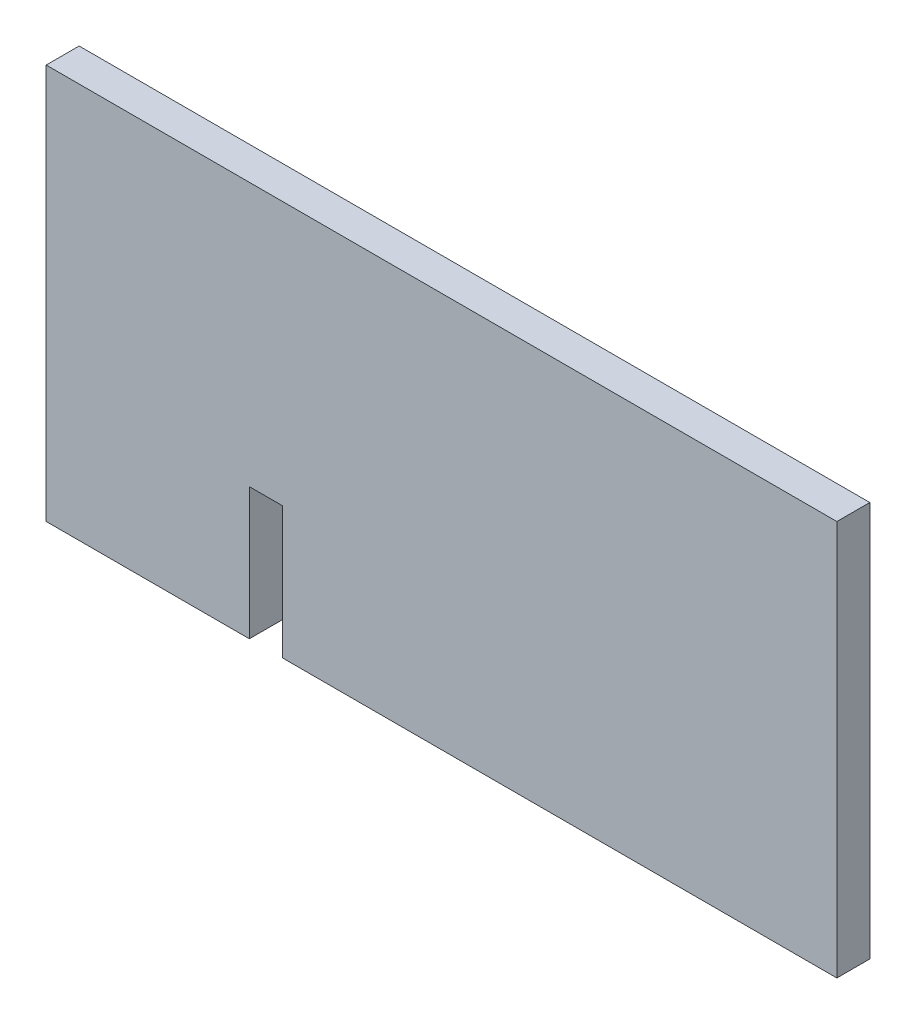
ISO-10303-21;
HEADER;
FILE_DESCRIPTION(('STEP AP214'),'2;1');
FILE_NAME('part.step','',(''),(''),'','','');
FILE_SCHEMA(('AUTOMOTIVE_DESIGN { 1 0 10303 214 1 1 1 1 }'));
ENDSEC;
DATA;
#1=APPLICATION_CONTEXT('core data for automotive mechanical design processes');
#2=APPLICATION_PROTOCOL_DEFINITION('international standard','automotive_design',2000,#1);
#3=PRODUCT_CONTEXT('',#1,'mechanical');
#4=PRODUCT('Part','Part','',(#3));
#5=PRODUCT_RELATED_PRODUCT_CATEGORY('part','',(#4));
#6=PRODUCT_DEFINITION_FORMATION('','',#4);
#7=PRODUCT_DEFINITION_CONTEXT('part definition',#1,'design');
#8=PRODUCT_DEFINITION('design','',#6,#7);
#9=PRODUCT_DEFINITION_SHAPE('','',#8);
#10=(LENGTH_UNIT() NAMED_UNIT(*) SI_UNIT(.MILLI.,.METRE.));
#11=(NAMED_UNIT(*) PLANE_ANGLE_UNIT() SI_UNIT($,.RADIAN.));
#12=(NAMED_UNIT(*) SI_UNIT($,.STERADIAN.) SOLID_ANGLE_UNIT());
#13=UNCERTAINTY_MEASURE_WITH_UNIT(LENGTH_MEASURE(1.E-05),#10,'distance_accuracy_value','');
#14=(GEOMETRIC_REPRESENTATION_CONTEXT(3) GLOBAL_UNCERTAINTY_ASSIGNED_CONTEXT((#13)) GLOBAL_UNIT_ASSIGNED_CONTEXT((#10,
#11,#12)) REPRESENTATION_CONTEXT('',''));
#15=CARTESIAN_POINT('',(0.,0.,0.));
#16=DIRECTION('',(0.,0.,1.));
#17=DIRECTION('',(1.,0.,0.));
#18=AXIS2_PLACEMENT_3D('',#15,#16,#17);
#19=CARTESIAN_POINT('',(-555.522580204597,0.,38.1));
#20=DIRECTION('',(0.,-1.,0.));
#21=DIRECTION('',(0.,0.,-1.));
#22=AXIS2_PLACEMENT_3D('',#19,#20,#21);
#23=PLANE('',#22);
#24=DIRECTION('',(0.,0.,-1.));
#25=VECTOR('',#24,1.);
#26=CARTESIAN_POINT('',(-679.45,0.,19.05));
#27=LINE('',#26,#25);
#28=CARTESIAN_POINT('',(-679.45,0.,38.1));
#29=VERTEX_POINT('',#28);
#30=CARTESIAN_POINT('',(-679.45,0.,0.));
#31=VERTEX_POINT('',#30);
#32=EDGE_CURVE('E203',#29,#31,#27,.T.);
#33=ORIENTED_EDGE('',*,*,#32,.F.);
#34=DIRECTION('',(-1.,0.,0.));
#35=VECTOR('',#34,1.);
#36=CARTESIAN_POINT('',(-555.522580204597,0.,38.1));
#37=LINE('',#36,#35);
#38=CARTESIAN_POINT('',(-914.4,0.,38.1));
#39=VERTEX_POINT('',#38);
#40=EDGE_CURVE('E50',#29,#39,#37,.T.);
#41=ORIENTED_EDGE('',*,*,#40,.T.);
#42=DIRECTION('',(0.,0.,-1.));
#43=VECTOR('',#42,1.);
#44=CARTESIAN_POINT('',(-914.4,0.,38.1));
#45=LINE('',#44,#43);
#46=CARTESIAN_POINT('',(-914.4,0.,0.));
#47=VERTEX_POINT('',#46);
#48=EDGE_CURVE('E156',#39,#47,#45,.T.);
#49=ORIENTED_EDGE('',*,*,#48,.T.);
#50=DIRECTION('',(-1.,0.,0.));
#51=VECTOR('',#50,1.);
#52=CARTESIAN_POINT('',(-555.522580204597,0.,0.));
#53=LINE('',#52,#51);
#54=EDGE_CURVE('E77',#31,#47,#53,.T.);
#55=ORIENTED_EDGE('',*,*,#54,.F.);
#56=EDGE_LOOP('',(#33,#41,#49,#55));
#57=FACE_BOUND('',#56,.T.);
#58=ADVANCED_FACE('F16',(#57),#23,.T.);
#59=CARTESIAN_POINT('',(-457.2,228.6,38.1));
#60=DIRECTION('',(0.,0.,1.));
#61=DIRECTION('',(1.,0.,0.));
#62=AXIS2_PLACEMENT_3D('',#59,#60,#61);
#63=PLANE('',#62);
#64=DIRECTION('',(-1.,0.,0.));
#65=VECTOR('',#64,1.);
#66=CARTESIAN_POINT('',(-555.522580204597,152.4,38.1));
#67=LINE('',#66,#65);
#68=CARTESIAN_POINT('',(-641.35,152.4,38.1));
#69=VERTEX_POINT('',#68);
#70=CARTESIAN_POINT('',(-679.45,152.4,38.1));
#71=VERTEX_POINT('',#70);
#72=EDGE_CURVE('E119',#69,#71,#67,.T.);
#73=ORIENTED_EDGE('',*,*,#72,.F.);
#74=DIRECTION('',(0.,-1.,0.));
#75=VECTOR('',#74,1.);
#76=CARTESIAN_POINT('',(-641.35,152.4,38.1));
#77=LINE('',#76,#75);
#78=CARTESIAN_POINT('',(-641.35,0.,38.1));
#79=VERTEX_POINT('',#78);
#80=EDGE_CURVE('E213',#69,#79,#77,.T.);
#81=ORIENTED_EDGE('',*,*,#80,.T.);
#82=CARTESIAN_POINT('',(0.,0.,38.1));
#83=VERTEX_POINT('',#82);
#84=EDGE_CURVE('E144',#83,#79,#37,.T.);
#85=ORIENTED_EDGE('',*,*,#84,.F.);
#86=DIRECTION('',(0.,1.,0.));
#87=VECTOR('',#86,1.);
#88=CARTESIAN_POINT('',(0.,228.6,38.1));
#89=LINE('',#88,#87);
#90=CARTESIAN_POINT('',(0.,457.2,38.1));
#91=VERTEX_POINT('',#90);
#92=EDGE_CURVE('E147',#83,#91,#89,.T.);
#93=ORIENTED_EDGE('',*,*,#92,.T.);
#94=DIRECTION('',(-1.,0.,0.));
#95=VECTOR('',#94,1.);
#96=CARTESIAN_POINT('',(-555.522580204597,457.2,38.1));
#97=LINE('',#96,#95);
#98=CARTESIAN_POINT('',(-914.4,457.2,38.1));
#99=VERTEX_POINT('',#98);
#100=EDGE_CURVE('E150',#91,#99,#97,.T.);
#101=ORIENTED_EDGE('',*,*,#100,.T.);
#102=DIRECTION('',(0.,1.,0.));
#103=VECTOR('',#102,1.);
#104=CARTESIAN_POINT('',(-914.4,228.6,38.1));
#105=LINE('',#104,#103);
#106=EDGE_CURVE('E153',#39,#99,#105,.T.);
#107=ORIENTED_EDGE('',*,*,#106,.F.);
#108=ORIENTED_EDGE('',*,*,#40,.F.);
#109=DIRECTION('',(0.,-1.,0.));
#110=VECTOR('',#109,1.);
#111=CARTESIAN_POINT('',(-679.45,152.4,38.1));
#112=LINE('',#111,#110);
#113=EDGE_CURVE('E114',#71,#29,#112,.T.);
#114=ORIENTED_EDGE('',*,*,#113,.F.);
#115=EDGE_LOOP('',(#73,#81,#85,#93,#101,#107,#108,#114));
#116=FACE_BOUND('',#115,.T.);
#117=ADVANCED_FACE('F131',(#116),#63,.T.);
#118=DIRECTION('',(0.,0.,1.));
#119=VECTOR('',#118,1.);
#120=CARTESIAN_POINT('',(-641.35,0.,19.05));
#121=LINE('',#120,#119);
#122=CARTESIAN_POINT('',(-641.35,0.,0.));
#123=VERTEX_POINT('',#122);
#124=EDGE_CURVE('E129',#123,#79,#121,.T.);
#125=ORIENTED_EDGE('',*,*,#124,.F.);
#126=CARTESIAN_POINT('',(0.,0.,0.));
#127=VERTEX_POINT('',#126);
#128=EDGE_CURVE('E138',#127,#123,#53,.T.);
#129=ORIENTED_EDGE('',*,*,#128,.F.);
#130=DIRECTION('',(0.,0.,-1.));
#131=VECTOR('',#130,1.);
#132=CARTESIAN_POINT('',(0.,0.,38.1));
#133=LINE('',#132,#131);
#134=EDGE_CURVE('E11',#83,#127,#133,.T.);
#135=ORIENTED_EDGE('',*,*,#134,.F.);
#136=ORIENTED_EDGE('',*,*,#84,.T.);
#137=EDGE_LOOP('',(#125,#129,#135,#136));
#138=FACE_BOUND('',#137,.T.);
#139=ADVANCED_FACE('F18',(#138),#23,.T.);
#140=CARTESIAN_POINT('',(0.,228.6,38.1));
#141=DIRECTION('',(-1.,0.,0.));
#142=DIRECTION('',(0.,0.,1.));
#143=AXIS2_PLACEMENT_3D('',#140,#141,#142);
#144=PLANE('',#143);
#145=DIRECTION('',(0.,1.,0.));
#146=VECTOR('',#145,1.);
#147=CARTESIAN_POINT('',(0.,228.6,0.));
#148=LINE('',#147,#146);
#149=CARTESIAN_POINT('',(0.,457.2,0.));
#150=VERTEX_POINT('',#149);
#151=EDGE_CURVE('E160',#127,#150,#148,.T.);
#152=ORIENTED_EDGE('',*,*,#151,.T.);
#153=DIRECTION('',(0.,0.,-1.));
#154=VECTOR('',#153,1.);
#155=CARTESIAN_POINT('',(0.,457.2,38.1));
#156=LINE('',#155,#154);
#157=EDGE_CURVE('E25',#91,#150,#156,.T.);
#158=ORIENTED_EDGE('',*,*,#157,.F.);
#159=ORIENTED_EDGE('',*,*,#92,.F.);
#160=ORIENTED_EDGE('',*,*,#134,.T.);
#161=EDGE_LOOP('',(#152,#158,#159,#160));
#162=FACE_BOUND('',#161,.T.);
#163=ADVANCED_FACE('F190',(#162),#144,.F.);
#164=CARTESIAN_POINT('',(-555.522580204597,457.2,38.1));
#165=DIRECTION('',(0.,-1.,0.));
#166=DIRECTION('',(0.,0.,-1.));
#167=AXIS2_PLACEMENT_3D('',#164,#165,#166);
#168=PLANE('',#167);
#169=DIRECTION('',(-1.,0.,0.));
#170=VECTOR('',#169,1.);
#171=CARTESIAN_POINT('',(-555.522580204597,457.2,0.));
#172=LINE('',#171,#170);
#173=CARTESIAN_POINT('',(-914.4,457.2,0.));
#174=VERTEX_POINT('',#173);
#175=EDGE_CURVE('E163',#150,#174,#172,.T.);
#176=ORIENTED_EDGE('',*,*,#175,.T.);
#177=DIRECTION('',(0.,0.,-1.));
#178=VECTOR('',#177,1.);
#179=CARTESIAN_POINT('',(-914.4,457.2,38.1));
#180=LINE('',#179,#178);
#181=EDGE_CURVE('E172',#99,#174,#180,.T.);
#182=ORIENTED_EDGE('',*,*,#181,.F.);
#183=ORIENTED_EDGE('',*,*,#100,.F.);
#184=ORIENTED_EDGE('',*,*,#157,.T.);
#185=EDGE_LOOP('',(#176,#182,#183,#184));
#186=FACE_BOUND('',#185,.T.);
#187=ADVANCED_FACE('F181',(#186),#168,.F.);
#188=CARTESIAN_POINT('',(-914.4,228.6,38.1));
#189=DIRECTION('',(-1.,0.,0.));
#190=DIRECTION('',(0.,-1.,0.));
#191=AXIS2_PLACEMENT_3D('',#188,#189,#190);
#192=PLANE('',#191);
#193=DIRECTION('',(0.,1.,0.));
#194=VECTOR('',#193,1.);
#195=CARTESIAN_POINT('',(-914.4,228.6,0.));
#196=LINE('',#195,#194);
#197=EDGE_CURVE('E167',#47,#174,#196,.T.);
#198=ORIENTED_EDGE('',*,*,#197,.F.);
#199=ORIENTED_EDGE('',*,*,#48,.F.);
#200=ORIENTED_EDGE('',*,*,#106,.T.);
#201=ORIENTED_EDGE('',*,*,#181,.T.);
#202=EDGE_LOOP('',(#198,#199,#200,#201));
#203=FACE_BOUND('',#202,.T.);
#204=ADVANCED_FACE('F188',(#203),#192,.T.);
#205=CARTESIAN_POINT('',(-457.2,228.6,0.));
#206=DIRECTION('',(0.,0.,1.));
#207=DIRECTION('',(1.,0.,0.));
#208=AXIS2_PLACEMENT_3D('',#205,#206,#207);
#209=PLANE('',#208);
#210=DIRECTION('',(-1.,0.,0.));
#211=VECTOR('',#210,1.);
#212=CARTESIAN_POINT('',(-555.522580204597,152.4,0.));
#213=LINE('',#212,#211);
#214=CARTESIAN_POINT('',(-641.35,152.4,0.));
#215=VERTEX_POINT('',#214);
#216=CARTESIAN_POINT('',(-679.45,152.4,0.));
#217=VERTEX_POINT('',#216);
#218=EDGE_CURVE('E118',#215,#217,#213,.T.);
#219=ORIENTED_EDGE('',*,*,#218,.T.);
#220=DIRECTION('',(0.,-1.,0.));
#221=VECTOR('',#220,1.);
#222=CARTESIAN_POINT('',(-679.45,152.4,0.));
#223=LINE('',#222,#221);
#224=EDGE_CURVE('E115',#217,#31,#223,.T.);
#225=ORIENTED_EDGE('',*,*,#224,.T.);
#226=ORIENTED_EDGE('',*,*,#54,.T.);
#227=ORIENTED_EDGE('',*,*,#197,.T.);
#228=ORIENTED_EDGE('',*,*,#175,.F.);
#229=ORIENTED_EDGE('',*,*,#151,.F.);
#230=ORIENTED_EDGE('',*,*,#128,.T.);
#231=DIRECTION('',(0.,-1.,0.));
#232=VECTOR('',#231,1.);
#233=CARTESIAN_POINT('',(-641.35,152.4,0.));
#234=LINE('',#233,#232);
#235=EDGE_CURVE('E140',#215,#123,#234,.T.);
#236=ORIENTED_EDGE('',*,*,#235,.F.);
#237=EDGE_LOOP('',(#219,#225,#226,#227,#228,#229,#230,#236));
#238=FACE_BOUND('',#237,.T.);
#239=ADVANCED_FACE('F185',(#238),#209,.F.);
#240=CARTESIAN_POINT('',(-679.45,152.4,19.05));
#241=DIRECTION('',(-1.,0.,0.));
#242=DIRECTION('',(0.,0.,1.));
#243=AXIS2_PLACEMENT_3D('',#240,#241,#242);
#244=PLANE('',#243);
#245=ORIENTED_EDGE('',*,*,#32,.T.);
#246=ORIENTED_EDGE('',*,*,#224,.F.);
#247=DIRECTION('',(0.,0.,-1.));
#248=VECTOR('',#247,1.);
#249=CARTESIAN_POINT('',(-679.45,152.4,19.05));
#250=LINE('',#249,#248);
#251=EDGE_CURVE('E37',#71,#217,#250,.T.);
#252=ORIENTED_EDGE('',*,*,#251,.F.);
#253=ORIENTED_EDGE('',*,*,#113,.T.);
#254=EDGE_LOOP('',(#245,#246,#252,#253));
#255=FACE_BOUND('',#254,.T.);
#256=ADVANCED_FACE('F112',(#255),#244,.F.);
#257=CARTESIAN_POINT('',(-641.35,152.4,19.05));
#258=DIRECTION('',(1.,0.,0.));
#259=DIRECTION('',(0.,0.,-1.));
#260=AXIS2_PLACEMENT_3D('',#257,#258,#259);
#261=PLANE('',#260);
#262=ORIENTED_EDGE('',*,*,#124,.T.);
#263=ORIENTED_EDGE('',*,*,#80,.F.);
#264=DIRECTION('',(0.,0.,1.));
#265=VECTOR('',#264,1.);
#266=CARTESIAN_POINT('',(-641.35,152.4,19.05));
#267=LINE('',#266,#265);
#268=EDGE_CURVE('E125',#215,#69,#267,.T.);
#269=ORIENTED_EDGE('',*,*,#268,.F.);
#270=ORIENTED_EDGE('',*,*,#235,.T.);
#271=EDGE_LOOP('',(#262,#263,#269,#270));
#272=FACE_BOUND('',#271,.T.);
#273=ADVANCED_FACE('F219',(#272),#261,.F.);
#274=CARTESIAN_POINT('',(-457.2,152.4,19.05));
#275=DIRECTION('',(0.,-1.,0.));
#276=DIRECTION('',(1.,0.,0.));
#277=AXIS2_PLACEMENT_3D('',#274,#275,#276);
#278=PLANE('',#277);
#279=ORIENTED_EDGE('',*,*,#72,.T.);
#280=ORIENTED_EDGE('',*,*,#251,.T.);
#281=ORIENTED_EDGE('',*,*,#218,.F.);
#282=ORIENTED_EDGE('',*,*,#268,.T.);
#283=EDGE_LOOP('',(#279,#280,#281,#282));
#284=FACE_BOUND('',#283,.T.);
#285=ADVANCED_FACE('F123',(#284),#278,.T.);
#286=CLOSED_SHELL('',(#58,#117,#139,#163,#187,#204,#239,#256,#273,#285));
#287=MANIFOLD_SOLID_BREP('B1',#286);
#288=ADVANCED_BREP_SHAPE_REPRESENTATION('',(#18,#287),#14);
#289=SHAPE_DEFINITION_REPRESENTATION(#9,#288);
ENDSEC;
END-ISO-10303-21;
